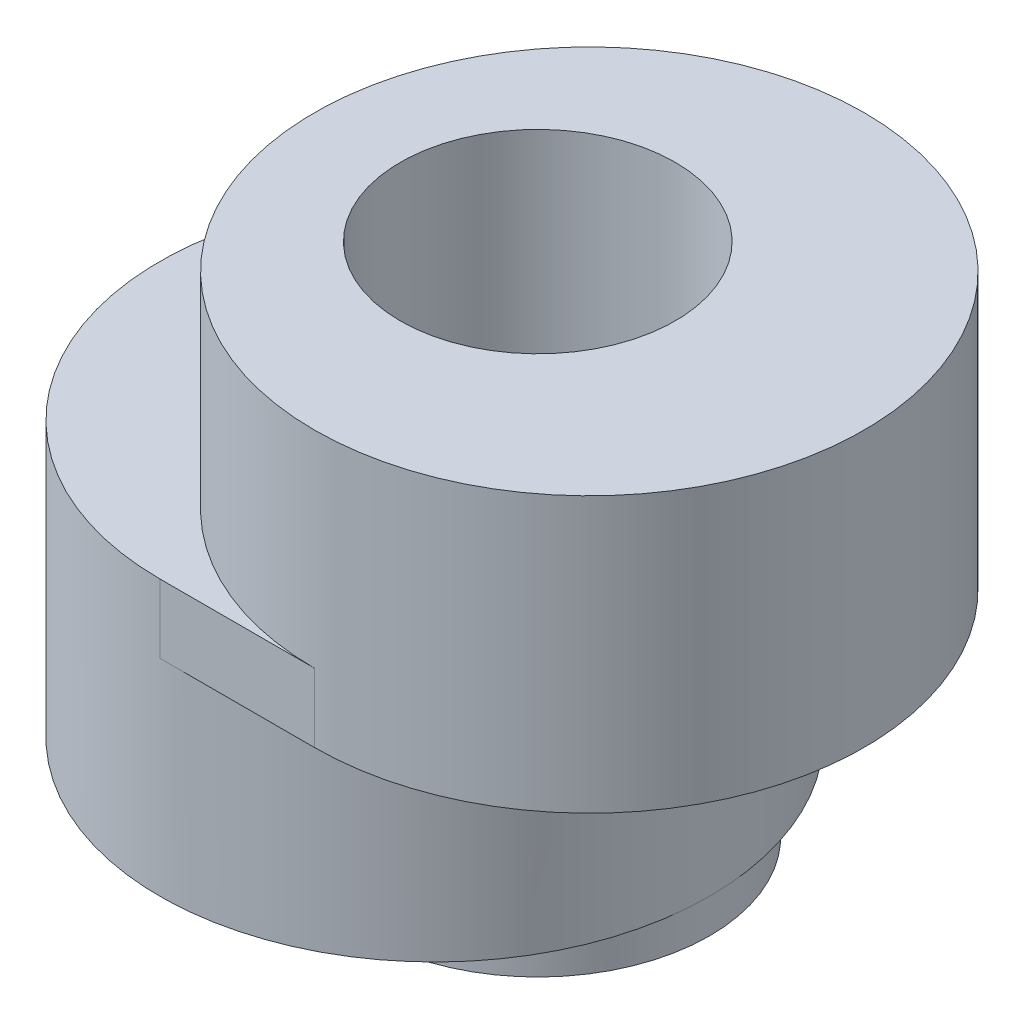
ISO-10303-21;
HEADER;
FILE_DESCRIPTION(('STEP AP214'),'2;1');
FILE_NAME('part.step','',(''),(''),'','','');
FILE_SCHEMA(('AUTOMOTIVE_DESIGN { 1 0 10303 214 1 1 1 1 }'));
ENDSEC;
DATA;
#1=APPLICATION_CONTEXT('core data for automotive mechanical design processes');
#2=APPLICATION_PROTOCOL_DEFINITION('international standard','automotive_design',2000,#1);
#3=PRODUCT_CONTEXT('',#1,'mechanical');
#4=PRODUCT('Part','Part','',(#3));
#5=PRODUCT_RELATED_PRODUCT_CATEGORY('part','',(#4));
#6=PRODUCT_DEFINITION_FORMATION('','',#4);
#7=PRODUCT_DEFINITION_CONTEXT('part definition',#1,'design');
#8=PRODUCT_DEFINITION('design','',#6,#7);
#9=PRODUCT_DEFINITION_SHAPE('','',#8);
#10=(LENGTH_UNIT() NAMED_UNIT(*) SI_UNIT(.MILLI.,.METRE.));
#11=(NAMED_UNIT(*) PLANE_ANGLE_UNIT() SI_UNIT($,.RADIAN.));
#12=(NAMED_UNIT(*) SI_UNIT($,.STERADIAN.) SOLID_ANGLE_UNIT());
#13=UNCERTAINTY_MEASURE_WITH_UNIT(LENGTH_MEASURE(1.E-05),#10,'distance_accuracy_value','');
#14=(GEOMETRIC_REPRESENTATION_CONTEXT(3) GLOBAL_UNCERTAINTY_ASSIGNED_CONTEXT((#13)) GLOBAL_UNIT_ASSIGNED_CONTEXT((#10,
#11,#12)) REPRESENTATION_CONTEXT('',''));
#15=CARTESIAN_POINT('',(0.,0.,0.));
#16=DIRECTION('',(0.,0.,1.));
#17=DIRECTION('',(1.,0.,0.));
#18=AXIS2_PLACEMENT_3D('',#15,#16,#17);
#19=CARTESIAN_POINT('',(-1.5,0.,0.));
#20=DIRECTION('',(0.,1.,0.));
#21=DIRECTION('',(0.,0.,1.));
#22=AXIS2_PLACEMENT_3D('',#19,#20,#21);
#23=PLANE('',#22);
#24=CARTESIAN_POINT('',(-1.5,0.,0.));
#25=DIRECTION('',(0.,1.,0.));
#26=DIRECTION('',(0.,0.,1.));
#27=AXIS2_PLACEMENT_3D('',#24,#25,#26);
#28=CIRCLE('',#27,4.);
#29=CARTESIAN_POINT('',(2.5,0.,0.));
#30=VERTEX_POINT('',#29);
#31=EDGE_CURVE('E92',#30,#30,#28,.T.);
#32=ORIENTED_EDGE('',*,*,#31,.F.);
#33=CARTESIAN_POINT('',(0.,0.,0.));
#34=DIRECTION('',(0.,-1.,0.));
#35=DIRECTION('',(0.,0.,-1.));
#36=AXIS2_PLACEMENT_3D('',#33,#34,#35);
#37=CIRCLE('',#36,2.5);
#38=EDGE_CURVE('E94',#30,#30,#37,.T.);
#39=ORIENTED_EDGE('',*,*,#38,.F.);
#40=EDGE_LOOP('',(#32,#39));
#41=FACE_BOUND('',#40,.T.);
#42=ADVANCED_FACE('F35',(#41),#23,.F.);
#43=CARTESIAN_POINT('',(-1.5,3.,0.));
#44=DIRECTION('',(0.,-1.,0.));
#45=DIRECTION('',(0.,0.,-1.));
#46=AXIS2_PLACEMENT_3D('',#43,#44,#45);
#47=CYLINDRICAL_SURFACE('',#46,4.);
#48=CARTESIAN_POINT('',(-1.5,3.,0.));
#49=DIRECTION('',(0.,1.,0.));
#50=DIRECTION('',(0.,0.,1.));
#51=AXIS2_PLACEMENT_3D('',#48,#49,#50);
#52=CIRCLE('',#51,4.);
#53=CARTESIAN_POINT('',(-1.5,3.,4.));
#54=VERTEX_POINT('',#53);
#55=CARTESIAN_POINT('',(-1.5,3.,-4.));
#56=VERTEX_POINT('',#55);
#57=EDGE_CURVE('E44',#54,#56,#52,.T.);
#58=ORIENTED_EDGE('',*,*,#57,.F.);
#59=DIRECTION('',(0.,-1.,0.));
#60=VECTOR('',#59,1.);
#61=CARTESIAN_POINT('',(-1.5,4.,4.));
#62=LINE('',#61,#60);
#63=CARTESIAN_POINT('',(-1.5,4.,4.));
#64=VERTEX_POINT('',#63);
#65=EDGE_CURVE('E96',#64,#54,#62,.T.);
#66=ORIENTED_EDGE('',*,*,#65,.F.);
#67=CARTESIAN_POINT('',(-1.5,4.,0.));
#68=DIRECTION('',(0.,1.,0.));
#69=DIRECTION('',(0.,0.,1.));
#70=AXIS2_PLACEMENT_3D('',#67,#68,#69);
#71=CIRCLE('',#70,4.);
#72=CARTESIAN_POINT('',(-1.5,4.,-4.));
#73=VERTEX_POINT('',#72);
#74=EDGE_CURVE('E115',#73,#64,#71,.T.);
#75=ORIENTED_EDGE('',*,*,#74,.F.);
#76=DIRECTION('',(0.,-1.,0.));
#77=VECTOR('',#76,1.);
#78=CARTESIAN_POINT('',(-1.5,4.,-4.));
#79=LINE('',#78,#77);
#80=EDGE_CURVE('E118',#73,#56,#79,.T.);
#81=ORIENTED_EDGE('',*,*,#80,.T.);
#82=EDGE_LOOP('',(#58,#66,#75,#81));
#83=FACE_BOUND('',#82,.T.);
#84=ORIENTED_EDGE('',*,*,#31,.T.);
#85=EDGE_LOOP('',(#84));
#86=FACE_BOUND('',#85,.T.);
#87=ADVANCED_FACE('F37',(#83,#86),#47,.T.);
#88=CARTESIAN_POINT('',(0.,3.,0.));
#89=DIRECTION('',(0.,-1.,0.));
#90=DIRECTION('',(0.,0.,-1.));
#91=AXIS2_PLACEMENT_3D('',#88,#89,#90);
#92=CYLINDRICAL_SURFACE('',#91,2.);
#93=CARTESIAN_POINT('',(0.,7.,0.));
#94=DIRECTION('',(0.,1.,0.));
#95=DIRECTION('',(0.,0.,1.));
#96=AXIS2_PLACEMENT_3D('',#93,#94,#95);
#97=CIRCLE('',#96,2.);
#98=CARTESIAN_POINT('',(0.,7.,2.));
#99=VERTEX_POINT('',#98);
#100=EDGE_CURVE('E139',#99,#99,#97,.T.);
#101=ORIENTED_EDGE('',*,*,#100,.T.);
#102=EDGE_LOOP('',(#101));
#103=FACE_BOUND('',#102,.T.);
#104=CARTESIAN_POINT('',(0.,-0.5,0.));
#105=DIRECTION('',(0.,-1.,0.));
#106=DIRECTION('',(0.,0.,-1.));
#107=AXIS2_PLACEMENT_3D('',#104,#105,#106);
#108=CIRCLE('',#107,2.);
#109=CARTESIAN_POINT('',(0.,-0.5,-2.));
#110=VERTEX_POINT('',#109);
#111=EDGE_CURVE('E144',#110,#110,#108,.T.);
#112=ORIENTED_EDGE('',*,*,#111,.T.);
#113=EDGE_LOOP('',(#112));
#114=FACE_BOUND('',#113,.T.);
#115=ADVANCED_FACE('F150',(#103,#114),#92,.F.);
#116=CARTESIAN_POINT('',(-1.5,3.,0.));
#117=DIRECTION('',(0.,1.,0.));
#118=DIRECTION('',(0.,0.,1.));
#119=AXIS2_PLACEMENT_3D('',#116,#117,#118);
#120=PLANE('',#119);
#121=DIRECTION('',(1.,0.,0.));
#122=VECTOR('',#121,1.);
#123=CARTESIAN_POINT('',(-1.5,3.,4.));
#124=LINE('',#123,#122);
#125=CARTESIAN_POINT('',(0.75,3.,4.));
#126=VERTEX_POINT('',#125);
#127=EDGE_CURVE('E106',#54,#126,#124,.T.);
#128=ORIENTED_EDGE('',*,*,#127,.F.);
#129=ORIENTED_EDGE('',*,*,#57,.T.);
#130=DIRECTION('',(-1.,0.,0.));
#131=VECTOR('',#130,1.);
#132=CARTESIAN_POINT('',(-1.5,3.,-4.));
#133=LINE('',#132,#131);
#134=CARTESIAN_POINT('',(0.75,3.,-4.));
#135=VERTEX_POINT('',#134);
#136=EDGE_CURVE('E113',#135,#56,#133,.T.);
#137=ORIENTED_EDGE('',*,*,#136,.F.);
#138=CARTESIAN_POINT('',(0.75,3.,0.));
#139=DIRECTION('',(0.,1.,0.));
#140=DIRECTION('',(0.,0.,1.));
#141=AXIS2_PLACEMENT_3D('',#138,#139,#140);
#142=CIRCLE('',#141,4.);
#143=EDGE_CURVE('E77',#126,#135,#142,.T.);
#144=ORIENTED_EDGE('',*,*,#143,.F.);
#145=EDGE_LOOP('',(#128,#129,#137,#144));
#146=FACE_BOUND('',#145,.T.);
#147=ADVANCED_FACE('F175',(#146),#120,.F.);
#148=CARTESIAN_POINT('',(-1.5,4.,0.));
#149=DIRECTION('',(0.,1.,0.));
#150=DIRECTION('',(0.,0.,1.));
#151=AXIS2_PLACEMENT_3D('',#148,#149,#150);
#152=PLANE('',#151);
#153=CARTESIAN_POINT('',(0.75,4.,0.));
#154=DIRECTION('',(0.,1.,0.));
#155=DIRECTION('',(0.,0.,1.));
#156=AXIS2_PLACEMENT_3D('',#153,#154,#155);
#157=CIRCLE('',#156,4.);
#158=CARTESIAN_POINT('',(0.75,4.,-4.));
#159=VERTEX_POINT('',#158);
#160=CARTESIAN_POINT('',(0.750000000000002,4.,4.));
#161=VERTEX_POINT('',#160);
#162=EDGE_CURVE('E11',#159,#161,#157,.T.);
#163=ORIENTED_EDGE('',*,*,#162,.F.);
#164=DIRECTION('',(-1.,0.,0.));
#165=VECTOR('',#164,1.);
#166=CARTESIAN_POINT('',(-1.5,4.,-4.));
#167=LINE('',#166,#165);
#168=EDGE_CURVE('E60',#159,#73,#167,.T.);
#169=ORIENTED_EDGE('',*,*,#168,.T.);
#170=ORIENTED_EDGE('',*,*,#74,.T.);
#171=DIRECTION('',(1.,0.,0.));
#172=VECTOR('',#171,1.);
#173=CARTESIAN_POINT('',(-1.5,4.,4.));
#174=LINE('',#173,#172);
#175=EDGE_CURVE('E84',#64,#161,#174,.T.);
#176=ORIENTED_EDGE('',*,*,#175,.T.);
#177=EDGE_LOOP('',(#163,#169,#170,#176));
#178=FACE_BOUND('',#177,.T.);
#179=ADVANCED_FACE('F181',(#178),#152,.T.);
#180=CARTESIAN_POINT('',(-1.5,4.,4.));
#181=DIRECTION('',(0.,0.,-1.));
#182=DIRECTION('',(-1.,0.,0.));
#183=AXIS2_PLACEMENT_3D('',#180,#181,#182);
#184=PLANE('',#183);
#185=ORIENTED_EDGE('',*,*,#127,.T.);
#186=DIRECTION('',(0.,-1.,0.));
#187=VECTOR('',#186,1.);
#188=CARTESIAN_POINT('',(0.75,4.,4.));
#189=LINE('',#188,#187);
#190=EDGE_CURVE('E99',#161,#126,#189,.T.);
#191=ORIENTED_EDGE('',*,*,#190,.F.);
#192=ORIENTED_EDGE('',*,*,#175,.F.);
#193=ORIENTED_EDGE('',*,*,#65,.T.);
#194=EDGE_LOOP('',(#185,#191,#192,#193));
#195=FACE_BOUND('',#194,.T.);
#196=ADVANCED_FACE('F177',(#195),#184,.F.);
#197=CARTESIAN_POINT('',(0.75,4.,0.));
#198=DIRECTION('',(0.,-1.,0.));
#199=DIRECTION('',(0.,0.,-1.));
#200=AXIS2_PLACEMENT_3D('',#197,#198,#199);
#201=CYLINDRICAL_SURFACE('',#200,4.);
#202=ORIENTED_EDGE('',*,*,#143,.T.);
#203=DIRECTION('',(0.,-1.,0.));
#204=VECTOR('',#203,1.);
#205=CARTESIAN_POINT('',(0.75,4.,-4.));
#206=LINE('',#205,#204);
#207=EDGE_CURVE('E121',#159,#135,#206,.T.);
#208=ORIENTED_EDGE('',*,*,#207,.F.);
#209=ORIENTED_EDGE('',*,*,#162,.T.);
#210=ORIENTED_EDGE('',*,*,#190,.T.);
#211=EDGE_LOOP('',(#202,#208,#209,#210));
#212=FACE_BOUND('',#211,.T.);
#213=CARTESIAN_POINT('',(0.75,7.,0.));
#214=DIRECTION('',(0.,1.,0.));
#215=DIRECTION('',(0.,0.,1.));
#216=AXIS2_PLACEMENT_3D('',#213,#214,#215);
#217=CIRCLE('',#216,4.);
#218=CARTESIAN_POINT('',(0.75,7.,4.));
#219=VERTEX_POINT('',#218);
#220=EDGE_CURVE('E108',#219,#219,#217,.T.);
#221=ORIENTED_EDGE('',*,*,#220,.F.);
#222=EDGE_LOOP('',(#221));
#223=FACE_BOUND('',#222,.T.);
#224=ADVANCED_FACE('F180',(#212,#223),#201,.T.);
#225=CARTESIAN_POINT('',(-1.5,4.,-4.));
#226=DIRECTION('',(0.,0.,1.));
#227=DIRECTION('',(1.,0.,0.));
#228=AXIS2_PLACEMENT_3D('',#225,#226,#227);
#229=PLANE('',#228);
#230=ORIENTED_EDGE('',*,*,#136,.T.);
#231=ORIENTED_EDGE('',*,*,#80,.F.);
#232=ORIENTED_EDGE('',*,*,#168,.F.);
#233=ORIENTED_EDGE('',*,*,#207,.T.);
#234=EDGE_LOOP('',(#230,#231,#232,#233));
#235=FACE_BOUND('',#234,.T.);
#236=ADVANCED_FACE('F164',(#235),#229,.F.);
#237=CARTESIAN_POINT('',(0.75,7.,0.));
#238=DIRECTION('',(0.,1.,0.));
#239=DIRECTION('',(0.,0.,1.));
#240=AXIS2_PLACEMENT_3D('',#237,#238,#239);
#241=PLANE('',#240);
#242=ORIENTED_EDGE('',*,*,#220,.T.);
#243=EDGE_LOOP('',(#242));
#244=FACE_BOUND('',#243,.T.);
#245=ORIENTED_EDGE('',*,*,#100,.F.);
#246=EDGE_LOOP('',(#245));
#247=FACE_BOUND('',#246,.T.);
#248=ADVANCED_FACE('F155',(#244,#247),#241,.T.);
#249=CARTESIAN_POINT('',(0.,-0.5,0.));
#250=DIRECTION('',(0.,-1.,0.));
#251=DIRECTION('',(0.,0.,-1.));
#252=AXIS2_PLACEMENT_3D('',#249,#250,#251);
#253=PLANE('',#252);
#254=CARTESIAN_POINT('',(0.,-0.5,0.));
#255=DIRECTION('',(0.,-1.,0.));
#256=DIRECTION('',(0.,0.,-1.));
#257=AXIS2_PLACEMENT_3D('',#254,#255,#256);
#258=CIRCLE('',#257,2.5);
#259=CARTESIAN_POINT('',(0.,-0.5,-2.5));
#260=VERTEX_POINT('',#259);
#261=EDGE_CURVE('E142',#260,#260,#258,.T.);
#262=ORIENTED_EDGE('',*,*,#261,.T.);
#263=EDGE_LOOP('',(#262));
#264=FACE_BOUND('',#263,.T.);
#265=ORIENTED_EDGE('',*,*,#111,.F.);
#266=EDGE_LOOP('',(#265));
#267=FACE_BOUND('',#266,.T.);
#268=ADVANCED_FACE('F152',(#264,#267),#253,.T.);
#269=CARTESIAN_POINT('',(0.,-0.5,0.));
#270=DIRECTION('',(0.,1.,0.));
#271=DIRECTION('',(0.,0.,1.));
#272=AXIS2_PLACEMENT_3D('',#269,#270,#271);
#273=CYLINDRICAL_SURFACE('',#272,2.5);
#274=ORIENTED_EDGE('',*,*,#261,.F.);
#275=EDGE_LOOP('',(#274));
#276=FACE_BOUND('',#275,.T.);
#277=ORIENTED_EDGE('',*,*,#38,.T.);
#278=EDGE_LOOP('',(#277));
#279=FACE_BOUND('',#278,.T.);
#280=ADVANCED_FACE('F154',(#276,#279),#273,.T.);
#281=CLOSED_SHELL('',(#42,#87,#115,#147,#179,#196,#224,#236,#248,#268,#280));
#282=MANIFOLD_SOLID_BREP('B2',#281);
#283=ADVANCED_BREP_SHAPE_REPRESENTATION('',(#18,#282),#14);
#284=SHAPE_DEFINITION_REPRESENTATION(#9,#283);
ENDSEC;
END-ISO-10303-21;
